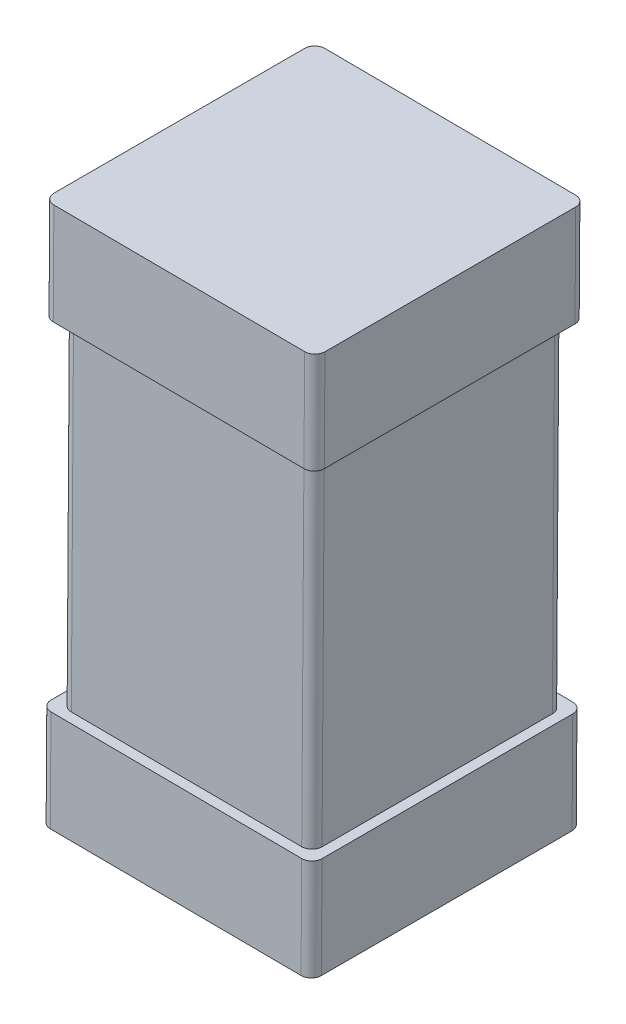
ISO-10303-21;
HEADER;
FILE_DESCRIPTION(('STEP AP214'),'2;1');
FILE_NAME('part.step','',(''),(''),'','','');
FILE_SCHEMA(('AUTOMOTIVE_DESIGN { 1 0 10303 214 1 1 1 1 }'));
ENDSEC;
DATA;
#1=APPLICATION_CONTEXT('core data for automotive mechanical design processes');
#2=APPLICATION_PROTOCOL_DEFINITION('international standard','automotive_design',2000,#1);
#3=PRODUCT_CONTEXT('',#1,'mechanical');
#4=PRODUCT('Part','Part','',(#3));
#5=PRODUCT_RELATED_PRODUCT_CATEGORY('part','',(#4));
#6=PRODUCT_DEFINITION_FORMATION('','',#4);
#7=PRODUCT_DEFINITION_CONTEXT('part definition',#1,'design');
#8=PRODUCT_DEFINITION('design','',#6,#7);
#9=PRODUCT_DEFINITION_SHAPE('','',#8);
#10=(LENGTH_UNIT() NAMED_UNIT(*) SI_UNIT(.MILLI.,.METRE.));
#11=(NAMED_UNIT(*) PLANE_ANGLE_UNIT() SI_UNIT($,.RADIAN.));
#12=(NAMED_UNIT(*) SI_UNIT($,.STERADIAN.) SOLID_ANGLE_UNIT());
#13=UNCERTAINTY_MEASURE_WITH_UNIT(LENGTH_MEASURE(1.E-05),#10,'distance_accuracy_value','');
#14=(GEOMETRIC_REPRESENTATION_CONTEXT(3) GLOBAL_UNCERTAINTY_ASSIGNED_CONTEXT((#13)) GLOBAL_UNIT_ASSIGNED_CONTEXT((#10,
#11,#12)) REPRESENTATION_CONTEXT('',''));
#15=CARTESIAN_POINT('',(0.,0.,0.));
#16=DIRECTION('',(0.,0.,1.));
#17=DIRECTION('',(1.,0.,0.));
#18=AXIS2_PLACEMENT_3D('',#15,#16,#17);
#19=CARTESIAN_POINT('',(207.305024144553,97.4618621310373,142.211582908599));
#20=DIRECTION('',(0.00663069374923689,0.99997801670857,0.));
#21=DIRECTION('',(0.,0.,-1.));
#22=AXIS2_PLACEMENT_3D('',#19,#20,#21);
#23=PLANE('',#22);
#24=DIRECTION('',(0.,0.,1.));
#25=VECTOR('',#24,1.);
#26=CARTESIAN_POINT('',(207.305024144553,97.4618621310373,142.211582908599));
#27=LINE('',#26,#25);
#28=CARTESIAN_POINT('',(207.305024144553,97.4618621310373,142.241582908599));
#29=VERTEX_POINT('',#28);
#30=CARTESIAN_POINT('',(207.305024144553,97.4618621310373,142.981582908599));
#31=VERTEX_POINT('',#30);
#32=EDGE_CURVE('E67',#29,#31,#27,.T.);
#33=ORIENTED_EDGE('',*,*,#32,.F.);
#34=CARTESIAN_POINT('',(207.275024804051,97.4620610518497,142.241582908599));
#35=DIRECTION('',(0.00663069374923689,0.99997801670857,0.));
#36=DIRECTION('',(0.,0.,1.));
#37=AXIS2_PLACEMENT_3D('',#34,#35,#36);
#38=CIRCLE('',#37,0.0300000000000023);
#39=CARTESIAN_POINT('',(207.275024804051,97.4620610518497,142.211582908599));
#40=VERTEX_POINT('',#39);
#41=EDGE_CURVE('E11',#29,#40,#38,.T.);
#42=ORIENTED_EDGE('',*,*,#41,.T.);
#43=DIRECTION('',(-0.999978016708569,0.00663069374923689,0.));
#44=VECTOR('',#43,1.);
#45=CARTESIAN_POINT('',(207.305024144553,97.4618621310373,142.211582908599));
#46=LINE('',#45,#44);
#47=CARTESIAN_POINT('',(206.535041071687,97.4669677652242,142.211582908599));
#48=VERTEX_POINT('',#47);
#49=EDGE_CURVE('E55',#40,#48,#46,.T.);
#50=ORIENTED_EDGE('',*,*,#49,.T.);
#51=CARTESIAN_POINT('',(206.535041071687,97.4669677652242,142.241582908599));
#52=DIRECTION('',(-0.00663069374923689,-0.99997801670857,0.));
#53=DIRECTION('',(0.,0.,1.));
#54=AXIS2_PLACEMENT_3D('',#51,#52,#53);
#55=CIRCLE('',#54,0.0300000000000023);
#56=CARTESIAN_POINT('',(206.505041731186,97.4671666860366,142.241582908599));
#57=VERTEX_POINT('',#56);
#58=EDGE_CURVE('E323',#57,#48,#55,.T.);
#59=ORIENTED_EDGE('',*,*,#58,.F.);
#60=DIRECTION('',(0.,0.,1.));
#61=VECTOR('',#60,1.);
#62=CARTESIAN_POINT('',(206.505041731186,97.4671666860366,142.211582908599));
#63=LINE('',#62,#61);
#64=CARTESIAN_POINT('',(206.505041731186,97.4671666860366,142.981582908599));
#65=VERTEX_POINT('',#64);
#66=EDGE_CURVE('E412',#57,#65,#63,.T.);
#67=ORIENTED_EDGE('',*,*,#66,.T.);
#68=CARTESIAN_POINT('',(206.535041071687,97.4669677652242,142.981582908599));
#69=DIRECTION('',(0.00663069374923689,0.99997801670857,0.));
#70=DIRECTION('',(0.,0.,1.));
#71=AXIS2_PLACEMENT_3D('',#68,#69,#70);
#72=CIRCLE('',#71,0.0300000000000023);
#73=CARTESIAN_POINT('',(206.535041071687,97.4669677652242,143.011582908599));
#74=VERTEX_POINT('',#73);
#75=EDGE_CURVE('E380',#65,#74,#72,.T.);
#76=ORIENTED_EDGE('',*,*,#75,.T.);
#77=DIRECTION('',(-0.999978016708569,0.00663069374923689,0.));
#78=VECTOR('',#77,1.);
#79=CARTESIAN_POINT('',(207.305024144553,97.4618621310373,143.011582908599));
#80=LINE('',#79,#78);
#81=CARTESIAN_POINT('',(207.275024804051,97.4620610518497,143.011582908599));
#82=VERTEX_POINT('',#81);
#83=EDGE_CURVE('E324',#82,#74,#80,.T.);
#84=ORIENTED_EDGE('',*,*,#83,.F.);
#85=CARTESIAN_POINT('',(207.275024804051,97.4620610518497,142.981582908599));
#86=DIRECTION('',(-0.00663069374923689,-0.99997801670857,0.));
#87=DIRECTION('',(0.,0.,1.));
#88=AXIS2_PLACEMENT_3D('',#85,#86,#87);
#89=CIRCLE('',#88,0.0300000000000023);
#90=EDGE_CURVE('E368',#31,#82,#89,.T.);
#91=ORIENTED_EDGE('',*,*,#90,.F.);
#92=EDGE_LOOP('',(#33,#42,#50,#59,#67,#76,#84,#91));
#93=FACE_BOUND('',#92,.T.);
#94=ADVANCED_FACE('F44',(#93),#23,.T.);
#95=CARTESIAN_POINT('',(206.503052523061,97.1671732810241,142.211582908599));
#96=DIRECTION('',(-0.99997801670857,0.00663069374923689,0.));
#97=DIRECTION('',(0.,0.,1.));
#98=AXIS2_PLACEMENT_3D('',#95,#96,#97);
#99=PLANE('',#98);
#100=ORIENTED_EDGE('',*,*,#66,.F.);
#101=DIRECTION('',(0.00663069374923689,0.999978016708569,0.));
#102=VECTOR('',#101,1.);
#103=CARTESIAN_POINT('',(206.503052523061,97.1671732810241,142.241582908599));
#104=LINE('',#103,#102);
#105=CARTESIAN_POINT('',(206.503052523061,97.1671732810241,142.241582908599));
#106=VERTEX_POINT('',#105);
#107=EDGE_CURVE('E347',#106,#57,#104,.T.);
#108=ORIENTED_EDGE('',*,*,#107,.F.);
#109=DIRECTION('',(0.,0.,1.));
#110=VECTOR('',#109,1.);
#111=CARTESIAN_POINT('',(206.503052523061,97.1671732810241,142.211582908599));
#112=LINE('',#111,#110);
#113=CARTESIAN_POINT('',(206.503052523061,97.1671732810241,142.981582908599));
#114=VERTEX_POINT('',#113);
#115=EDGE_CURVE('E376',#106,#114,#112,.T.);
#116=ORIENTED_EDGE('',*,*,#115,.T.);
#117=DIRECTION('',(0.00663069374923689,0.999978016708569,0.));
#118=VECTOR('',#117,1.);
#119=CARTESIAN_POINT('',(206.503052523061,97.1671732810241,142.981582908599));
#120=LINE('',#119,#118);
#121=EDGE_CURVE('E342',#114,#65,#120,.T.);
#122=ORIENTED_EDGE('',*,*,#121,.T.);
#123=EDGE_LOOP('',(#100,#108,#116,#122));
#124=FACE_BOUND('',#123,.T.);
#125=ADVANCED_FACE('F587',(#124),#99,.T.);
#126=CARTESIAN_POINT('',(206.533051863562,97.1669743602116,142.981582908599));
#127=DIRECTION('',(0.00663069374915559,0.99997801670857,0.));
#128=DIRECTION('',(-0.99997801670857,0.00663069374915559,0.));
#129=AXIS2_PLACEMENT_3D('',#126,#127,#128);
#130=CYLINDRICAL_SURFACE('',#129,0.0300000000000117);
#131=CARTESIAN_POINT('',(206.533051863562,97.1669743602116,142.981582908599));
#132=DIRECTION('',(0.00663069374923689,0.99997801670857,0.));
#133=DIRECTION('',(0.,0.,1.));
#134=AXIS2_PLACEMENT_3D('',#131,#132,#133);
#135=CIRCLE('',#134,0.0300000000000023);
#136=CARTESIAN_POINT('',(206.533051863562,97.1669743602116,143.011582908599));
#137=VERTEX_POINT('',#136);
#138=EDGE_CURVE('E338',#114,#137,#135,.T.);
#139=ORIENTED_EDGE('',*,*,#138,.T.);
#140=DIRECTION('',(0.00663069374923689,0.999978016708569,0.));
#141=VECTOR('',#140,1.);
#142=CARTESIAN_POINT('',(206.533051863562,97.1669743602116,143.011582908599));
#143=LINE('',#142,#141);
#144=EDGE_CURVE('E343',#137,#74,#143,.T.);
#145=ORIENTED_EDGE('',*,*,#144,.T.);
#146=ORIENTED_EDGE('',*,*,#75,.F.);
#147=ORIENTED_EDGE('',*,*,#121,.F.);
#148=EDGE_LOOP('',(#139,#145,#146,#147));
#149=FACE_BOUND('',#148,.T.);
#150=ADVANCED_FACE('F591',(#149),#130,.T.);
#151=CARTESIAN_POINT('',(206.533051863562,97.1669743602116,142.241582908599));
#152=DIRECTION('',(0.00663069374915559,0.99997801670857,0.));
#153=DIRECTION('',(-0.99997801670857,0.00663069374915559,0.));
#154=AXIS2_PLACEMENT_3D('',#151,#152,#153);
#155=CYLINDRICAL_SURFACE('',#154,0.0300000000000117);
#156=ORIENTED_EDGE('',*,*,#107,.T.);
#157=ORIENTED_EDGE('',*,*,#58,.T.);
#158=DIRECTION('',(0.00663069374923689,0.999978016708569,0.));
#159=VECTOR('',#158,1.);
#160=CARTESIAN_POINT('',(206.533051863562,97.1669743602116,142.211582908599));
#161=LINE('',#160,#159);
#162=CARTESIAN_POINT('',(206.533051863562,97.1669743602116,142.211582908599));
#163=VERTEX_POINT('',#162);
#164=EDGE_CURVE('E355',#163,#48,#161,.T.);
#165=ORIENTED_EDGE('',*,*,#164,.F.);
#166=CARTESIAN_POINT('',(206.533051863562,97.1669743602116,142.241582908599));
#167=DIRECTION('',(-0.00663069374923689,-0.99997801670857,0.));
#168=DIRECTION('',(0.,0.,1.));
#169=AXIS2_PLACEMENT_3D('',#166,#167,#168);
#170=CIRCLE('',#169,0.0300000000000023);
#171=EDGE_CURVE('E312',#106,#163,#170,.T.);
#172=ORIENTED_EDGE('',*,*,#171,.F.);
#173=EDGE_LOOP('',(#156,#157,#165,#172));
#174=FACE_BOUND('',#173,.T.);
#175=ADVANCED_FACE('F600',(#174),#155,.T.);
#176=CARTESIAN_POINT('',(207.303034936427,97.1618687260247,143.011582908599));
#177=DIRECTION('',(0.,0.,1.));
#178=DIRECTION('',(1.,0.,0.));
#179=AXIS2_PLACEMENT_3D('',#176,#177,#178);
#180=PLANE('',#179);
#181=DIRECTION('',(-0.999978016708569,0.00663069374923689,0.));
#182=VECTOR('',#181,1.);
#183=CARTESIAN_POINT('',(207.303034936427,97.1618687260247,143.011582908599));
#184=LINE('',#183,#182);
#185=CARTESIAN_POINT('',(207.273035595927,97.1620676468372,143.011582908599));
#186=VERTEX_POINT('',#185);
#187=EDGE_CURVE('E314',#186,#137,#184,.T.);
#188=ORIENTED_EDGE('',*,*,#187,.F.);
#189=DIRECTION('',(0.00663069374923689,0.999978016708569,0.));
#190=VECTOR('',#189,1.);
#191=CARTESIAN_POINT('',(207.273035595927,97.1620676468372,143.011582908599));
#192=LINE('',#191,#190);
#193=EDGE_CURVE('E319',#186,#82,#192,.T.);
#194=ORIENTED_EDGE('',*,*,#193,.T.);
#195=ORIENTED_EDGE('',*,*,#83,.T.);
#196=ORIENTED_EDGE('',*,*,#144,.F.);
#197=EDGE_LOOP('',(#188,#194,#195,#196));
#198=FACE_BOUND('',#197,.T.);
#199=ADVANCED_FACE('F603',(#198),#180,.T.);
#200=CARTESIAN_POINT('',(207.303034936427,97.1618687260247,142.211582908599));
#201=DIRECTION('',(0.,0.,1.));
#202=DIRECTION('',(1.,0.,0.));
#203=AXIS2_PLACEMENT_3D('',#200,#201,#202);
#204=PLANE('',#203);
#205=ORIENTED_EDGE('',*,*,#164,.T.);
#206=ORIENTED_EDGE('',*,*,#49,.F.);
#207=DIRECTION('',(0.00663069374923689,0.999978016708569,0.));
#208=VECTOR('',#207,1.);
#209=CARTESIAN_POINT('',(207.273035595927,97.1620676468372,142.211582908599));
#210=LINE('',#209,#208);
#211=CARTESIAN_POINT('',(207.273035595927,97.1620676468372,142.211582908599));
#212=VERTEX_POINT('',#211);
#213=EDGE_CURVE('E399',#212,#40,#210,.T.);
#214=ORIENTED_EDGE('',*,*,#213,.F.);
#215=DIRECTION('',(-0.999978016708569,0.00663069374923689,0.));
#216=VECTOR('',#215,1.);
#217=CARTESIAN_POINT('',(207.303034936427,97.1618687260247,142.211582908599));
#218=LINE('',#217,#216);
#219=EDGE_CURVE('E351',#212,#163,#218,.T.);
#220=ORIENTED_EDGE('',*,*,#219,.T.);
#221=EDGE_LOOP('',(#205,#206,#214,#220));
#222=FACE_BOUND('',#221,.T.);
#223=ADVANCED_FACE('F609',(#222),#204,.F.);
#224=CARTESIAN_POINT('',(207.273035595927,97.1620676468372,142.981582908599));
#225=DIRECTION('',(0.00663069374915559,0.99997801670857,0.));
#226=DIRECTION('',(0.99997801670857,-0.00663069374915559,0.));
#227=AXIS2_PLACEMENT_3D('',#224,#225,#226);
#228=CYLINDRICAL_SURFACE('',#227,0.0300000000000117);
#229=DIRECTION('',(0.00663069374923689,0.999978016708569,0.));
#230=VECTOR('',#229,1.);
#231=CARTESIAN_POINT('',(207.303034936427,97.1618687260247,142.981582908599));
#232=LINE('',#231,#230);
#233=CARTESIAN_POINT('',(207.303034936427,97.1618687260247,142.981582908599));
#234=VERTEX_POINT('',#233);
#235=EDGE_CURVE('E356',#234,#31,#232,.T.);
#236=ORIENTED_EDGE('',*,*,#235,.T.);
#237=ORIENTED_EDGE('',*,*,#90,.T.);
#238=ORIENTED_EDGE('',*,*,#193,.F.);
#239=CARTESIAN_POINT('',(207.273035595927,97.1620676468372,142.981582908599));
#240=DIRECTION('',(-0.00663069374923689,-0.99997801670857,0.));
#241=DIRECTION('',(0.,0.,1.));
#242=AXIS2_PLACEMENT_3D('',#239,#240,#241);
#243=CIRCLE('',#242,0.0300000000000023);
#244=EDGE_CURVE('E318',#234,#186,#243,.T.);
#245=ORIENTED_EDGE('',*,*,#244,.F.);
#246=EDGE_LOOP('',(#236,#237,#238,#245));
#247=FACE_BOUND('',#246,.T.);
#248=ADVANCED_FACE('F543',(#247),#228,.T.);
#249=CARTESIAN_POINT('',(207.273035595927,97.1620676468372,142.241582908599));
#250=DIRECTION('',(0.00663069374915559,0.99997801670857,0.));
#251=DIRECTION('',(0.99997801670857,-0.00663069374915559,0.));
#252=AXIS2_PLACEMENT_3D('',#249,#250,#251);
#253=CYLINDRICAL_SURFACE('',#252,0.0300000000000117);
#254=CARTESIAN_POINT('',(207.273035595927,97.1620676468372,142.241582908599));
#255=DIRECTION('',(0.00663069374923689,0.99997801670857,0.));
#256=DIRECTION('',(0.,0.,1.));
#257=AXIS2_PLACEMENT_3D('',#254,#255,#256);
#258=CIRCLE('',#257,0.0300000000000023);
#259=CARTESIAN_POINT('',(207.303034936427,97.1618687260247,142.241582908599));
#260=VERTEX_POINT('',#259);
#261=EDGE_CURVE('E297',#260,#212,#258,.T.);
#262=ORIENTED_EDGE('',*,*,#261,.T.);
#263=ORIENTED_EDGE('',*,*,#213,.T.);
#264=ORIENTED_EDGE('',*,*,#41,.F.);
#265=DIRECTION('',(0.00663069374923689,0.999978016708569,0.));
#266=VECTOR('',#265,1.);
#267=CARTESIAN_POINT('',(207.303034936427,97.1618687260247,142.241582908599));
#268=LINE('',#267,#266);
#269=EDGE_CURVE('E403',#260,#29,#268,.T.);
#270=ORIENTED_EDGE('',*,*,#269,.F.);
#271=EDGE_LOOP('',(#262,#263,#264,#270));
#272=FACE_BOUND('',#271,.T.);
#273=ADVANCED_FACE('F533',(#272),#253,.T.);
#274=CARTESIAN_POINT('',(207.303034936427,97.1618687260247,142.211582908599));
#275=DIRECTION('',(-0.99997801670857,0.00663069374923689,0.));
#276=DIRECTION('',(0.,0.,1.));
#277=AXIS2_PLACEMENT_3D('',#274,#275,#276);
#278=PLANE('',#277);
#279=ORIENTED_EDGE('',*,*,#235,.F.);
#280=DIRECTION('',(0.,0.,1.));
#281=VECTOR('',#280,1.);
#282=CARTESIAN_POINT('',(207.303034936427,97.1618687260247,142.211582908599));
#283=LINE('',#282,#281);
#284=EDGE_CURVE('E308',#260,#234,#283,.T.);
#285=ORIENTED_EDGE('',*,*,#284,.F.);
#286=ORIENTED_EDGE('',*,*,#269,.T.);
#287=ORIENTED_EDGE('',*,*,#32,.T.);
#288=EDGE_LOOP('',(#279,#285,#286,#287));
#289=FACE_BOUND('',#288,.T.);
#290=ADVANCED_FACE('F541',(#289),#278,.F.);
#291=CARTESIAN_POINT('',(207.303034936427,97.1618687260247,142.211582908599));
#292=DIRECTION('',(0.00663069374923689,0.99997801670857,0.));
#293=DIRECTION('',(0.,0.,-1.));
#294=AXIS2_PLACEMENT_3D('',#291,#292,#293);
#295=PLANE('',#294);
#296=ORIENTED_EDGE('',*,*,#244,.T.);
#297=ORIENTED_EDGE('',*,*,#187,.T.);
#298=ORIENTED_EDGE('',*,*,#138,.F.);
#299=ORIENTED_EDGE('',*,*,#115,.F.);
#300=ORIENTED_EDGE('',*,*,#171,.T.);
#301=ORIENTED_EDGE('',*,*,#219,.F.);
#302=ORIENTED_EDGE('',*,*,#261,.F.);
#303=ORIENTED_EDGE('',*,*,#284,.T.);
#304=EDGE_LOOP('',(#296,#297,#298,#299,#300,#301,#302,#303));
#305=FACE_BOUND('',#304,.T.);
#306=DIRECTION('',(-0.999978016708569,0.00663069374923689,0.));
#307=VECTOR('',#306,1.);
#308=CARTESIAN_POINT('',(207.273035595927,97.1620676468372,142.241582908599));
#309=LINE('',#308,#307);
#310=CARTESIAN_POINT('',(207.243036255425,97.1622665676496,142.241582908599));
#311=VERTEX_POINT('',#310);
#312=CARTESIAN_POINT('',(206.563051204063,97.1667754393991,142.241582908599));
#313=VERTEX_POINT('',#312);
#314=EDGE_CURVE('E313',#311,#313,#309,.T.);
#315=ORIENTED_EDGE('',*,*,#314,.T.);
#316=CARTESIAN_POINT('',(206.563051204063,97.1667754393991,142.271582908599));
#317=DIRECTION('',(-0.00663069374923689,-0.99997801670857,0.));
#318=DIRECTION('',(0.,0.,1.));
#319=AXIS2_PLACEMENT_3D('',#316,#317,#318);
#320=CIRCLE('',#319,0.0300000000000023);
#321=CARTESIAN_POINT('',(206.533051863562,97.1669743602116,142.271582908599));
#322=VERTEX_POINT('',#321);
#323=EDGE_CURVE('E334',#322,#313,#320,.T.);
#324=ORIENTED_EDGE('',*,*,#323,.F.);
#325=DIRECTION('',(0.,0.,1.));
#326=VECTOR('',#325,1.);
#327=CARTESIAN_POINT('',(206.533051863562,97.1669743602116,142.241582908599));
#328=LINE('',#327,#326);
#329=CARTESIAN_POINT('',(206.533051863562,97.1669743602116,142.951582908599));
#330=VERTEX_POINT('',#329);
#331=EDGE_CURVE('E419',#322,#330,#328,.T.);
#332=ORIENTED_EDGE('',*,*,#331,.T.);
#333=CARTESIAN_POINT('',(206.563051204063,97.1667754393991,142.951582908599));
#334=DIRECTION('',(0.00663069374923689,0.99997801670857,0.));
#335=DIRECTION('',(0.,0.,1.));
#336=AXIS2_PLACEMENT_3D('',#333,#334,#335);
#337=CIRCLE('',#336,0.0300000000000023);
#338=CARTESIAN_POINT('',(206.563051204063,97.1667754393991,142.981582908599));
#339=VERTEX_POINT('',#338);
#340=EDGE_CURVE('E437',#330,#339,#337,.T.);
#341=ORIENTED_EDGE('',*,*,#340,.T.);
#342=DIRECTION('',(-0.999978016708569,0.00663069374923689,0.));
#343=VECTOR('',#342,1.);
#344=CARTESIAN_POINT('',(207.273035595927,97.1620676468372,142.981582908599));
#345=LINE('',#344,#343);
#346=CARTESIAN_POINT('',(207.243036255425,97.1622665676496,142.981582908599));
#347=VERTEX_POINT('',#346);
#348=EDGE_CURVE('E303',#347,#339,#345,.T.);
#349=ORIENTED_EDGE('',*,*,#348,.F.);
#350=CARTESIAN_POINT('',(207.243036255425,97.1622665676496,142.951582908599));
#351=DIRECTION('',(-0.00663069374923689,-0.99997801670857,0.));
#352=DIRECTION('',(0.,0.,1.));
#353=AXIS2_PLACEMENT_3D('',#350,#351,#352);
#354=CIRCLE('',#353,0.0300000000000023);
#355=CARTESIAN_POINT('',(207.273035595927,97.1620676468372,142.951582908599));
#356=VERTEX_POINT('',#355);
#357=EDGE_CURVE('E469',#356,#347,#354,.T.);
#358=ORIENTED_EDGE('',*,*,#357,.F.);
#359=DIRECTION('',(0.,0.,1.));
#360=VECTOR('',#359,1.);
#361=CARTESIAN_POINT('',(207.273035595927,97.1620676468372,142.241582908599));
#362=LINE('',#361,#360);
#363=CARTESIAN_POINT('',(207.273035595927,97.1620676468372,142.271582908599));
#364=VERTEX_POINT('',#363);
#365=EDGE_CURVE('E456',#364,#356,#362,.T.);
#366=ORIENTED_EDGE('',*,*,#365,.F.);
#367=CARTESIAN_POINT('',(207.243036255425,97.1622665676496,142.271582908599));
#368=DIRECTION('',(0.00663069374923689,0.99997801670857,0.));
#369=DIRECTION('',(0.,0.,1.));
#370=AXIS2_PLACEMENT_3D('',#367,#368,#369);
#371=CIRCLE('',#370,0.0300000000000023);
#372=EDGE_CURVE('E455',#364,#311,#371,.T.);
#373=ORIENTED_EDGE('',*,*,#372,.T.);
#374=EDGE_LOOP('',(#315,#324,#332,#341,#349,#358,#366,#373));
#375=FACE_BOUND('',#374,.T.);
#376=ADVANCED_FACE('F538',(#305,#375),#295,.F.);
#377=CARTESIAN_POINT('',(207.266404902177,96.1620896301286,142.241582908599));
#378=DIRECTION('',(-0.99997801670857,0.00663069374923689,0.));
#379=DIRECTION('',(0.,0.,1.));
#380=AXIS2_PLACEMENT_3D('',#377,#378,#379);
#381=PLANE('',#380);
#382=DIRECTION('',(0.00663069374923689,0.999978016708569,0.));
#383=VECTOR('',#382,1.);
#384=CARTESIAN_POINT('',(207.266404902177,96.1620896301286,142.951582908599));
#385=LINE('',#384,#383);
#386=CARTESIAN_POINT('',(207.266404902177,96.1620896301286,142.951582908599));
#387=VERTEX_POINT('',#386);
#388=EDGE_CURVE('E465',#387,#356,#385,.T.);
#389=ORIENTED_EDGE('',*,*,#388,.F.);
#390=DIRECTION('',(0.,0.,1.));
#391=VECTOR('',#390,1.);
#392=CARTESIAN_POINT('',(207.266404902177,96.1620896301286,142.241582908599));
#393=LINE('',#392,#391);
#394=CARTESIAN_POINT('',(207.266404902177,96.1620896301286,142.271582908599));
#395=VERTEX_POINT('',#394);
#396=EDGE_CURVE('E276',#395,#387,#393,.T.);
#397=ORIENTED_EDGE('',*,*,#396,.F.);
#398=DIRECTION('',(0.00663069374923689,0.999978016708569,0.));
#399=VECTOR('',#398,1.);
#400=CARTESIAN_POINT('',(207.266404902177,96.1620896301286,142.271582908599));
#401=LINE('',#400,#399);
#402=EDGE_CURVE('E451',#395,#364,#401,.T.);
#403=ORIENTED_EDGE('',*,*,#402,.T.);
#404=ORIENTED_EDGE('',*,*,#365,.T.);
#405=EDGE_LOOP('',(#389,#397,#403,#404));
#406=FACE_BOUND('',#405,.T.);
#407=ADVANCED_FACE('F559',(#406),#381,.F.);
#408=CARTESIAN_POINT('',(207.236405561676,96.1622885509411,142.951582908599));
#409=DIRECTION('',(0.00663069374915559,0.99997801670857,0.));
#410=DIRECTION('',(0.99997801670857,-0.00663069374915559,0.));
#411=AXIS2_PLACEMENT_3D('',#408,#409,#410);
#412=CYLINDRICAL_SURFACE('',#411,0.0300000000000117);
#413=ORIENTED_EDGE('',*,*,#388,.T.);
#414=ORIENTED_EDGE('',*,*,#357,.T.);
#415=DIRECTION('',(0.00663069374923689,0.999978016708569,0.));
#416=VECTOR('',#415,1.);
#417=CARTESIAN_POINT('',(207.236405561676,96.1622885509411,142.981582908599));
#418=LINE('',#417,#416);
#419=CARTESIAN_POINT('',(207.236405561676,96.1622885509411,142.981582908599));
#420=VERTEX_POINT('',#419);
#421=EDGE_CURVE('E305',#420,#347,#418,.T.);
#422=ORIENTED_EDGE('',*,*,#421,.F.);
#423=CARTESIAN_POINT('',(207.236405561676,96.1622885509411,142.951582908599));
#424=DIRECTION('',(-0.00663069374923689,-0.99997801670857,0.));
#425=DIRECTION('',(0.,0.,1.));
#426=AXIS2_PLACEMENT_3D('',#423,#424,#425);
#427=CIRCLE('',#426,0.0300000000000023);
#428=EDGE_CURVE('E386',#387,#420,#427,.T.);
#429=ORIENTED_EDGE('',*,*,#428,.F.);
#430=EDGE_LOOP('',(#413,#414,#422,#429));
#431=FACE_BOUND('',#430,.T.);
#432=ADVANCED_FACE('F556',(#431),#412,.T.);
#433=CARTESIAN_POINT('',(207.266404902177,96.1620896301286,142.981582908599));
#434=DIRECTION('',(0.,0.,1.));
#435=DIRECTION('',(1.,0.,0.));
#436=AXIS2_PLACEMENT_3D('',#433,#434,#435);
#437=PLANE('',#436);
#438=DIRECTION('',(-0.999978016708569,0.00663069374923689,0.));
#439=VECTOR('',#438,1.);
#440=CARTESIAN_POINT('',(207.266404902177,96.1620896301286,142.981582908599));
#441=LINE('',#440,#439);
#442=CARTESIAN_POINT('',(206.556420510314,96.1667974226905,142.981582908599));
#443=VERTEX_POINT('',#442);
#444=EDGE_CURVE('E360',#420,#443,#441,.T.);
#445=ORIENTED_EDGE('',*,*,#444,.F.);
#446=ORIENTED_EDGE('',*,*,#421,.T.);
#447=ORIENTED_EDGE('',*,*,#348,.T.);
#448=DIRECTION('',(0.00663069374923689,0.999978016708569,0.));
#449=VECTOR('',#448,1.);
#450=CARTESIAN_POINT('',(206.556420510314,96.1667974226905,142.981582908599));
#451=LINE('',#450,#449);
#452=EDGE_CURVE('E394',#443,#339,#451,.T.);
#453=ORIENTED_EDGE('',*,*,#452,.F.);
#454=EDGE_LOOP('',(#445,#446,#447,#453));
#455=FACE_BOUND('',#454,.T.);
#456=ADVANCED_FACE('F46',(#455),#437,.T.);
#457=CARTESIAN_POINT('',(206.556420510314,96.1667974226905,142.951582908599));
#458=DIRECTION('',(0.00663069374915559,0.99997801670857,0.));
#459=DIRECTION('',(-0.99997801670857,0.00663069374915559,0.));
#460=AXIS2_PLACEMENT_3D('',#457,#458,#459);
#461=CYLINDRICAL_SURFACE('',#460,0.0300000000000117);
#462=CARTESIAN_POINT('',(206.556420510314,96.1667974226905,142.951582908599));
#463=DIRECTION('',(0.00663069374923689,0.99997801670857,0.));
#464=DIRECTION('',(0.,0.,1.));
#465=AXIS2_PLACEMENT_3D('',#462,#463,#464);
#466=CIRCLE('',#465,0.0300000000000023);
#467=CARTESIAN_POINT('',(206.526421169813,96.166996343503,142.951582908599));
#468=VERTEX_POINT('',#467);
#469=EDGE_CURVE('E306',#468,#443,#466,.T.);
#470=ORIENTED_EDGE('',*,*,#469,.T.);
#471=ORIENTED_EDGE('',*,*,#452,.T.);
#472=ORIENTED_EDGE('',*,*,#340,.F.);
#473=DIRECTION('',(0.00663069374923689,0.999978016708569,0.));
#474=VECTOR('',#473,1.);
#475=CARTESIAN_POINT('',(206.526421169813,96.166996343503,142.951582908599));
#476=LINE('',#475,#474);
#477=EDGE_CURVE('E426',#468,#330,#476,.T.);
#478=ORIENTED_EDGE('',*,*,#477,.F.);
#479=EDGE_LOOP('',(#470,#471,#472,#478));
#480=FACE_BOUND('',#479,.T.);
#481=ADVANCED_FACE('F582',(#480),#461,.T.);
#482=CARTESIAN_POINT('',(206.526421169813,96.166996343503,142.241582908599));
#483=DIRECTION('',(-0.99997801670857,0.00663069374923689,0.));
#484=DIRECTION('',(0.,0.,1.));
#485=AXIS2_PLACEMENT_3D('',#482,#483,#484);
#486=PLANE('',#485);
#487=ORIENTED_EDGE('',*,*,#331,.F.);
#488=DIRECTION('',(0.00663069374923689,0.999978016708569,0.));
#489=VECTOR('',#488,1.);
#490=CARTESIAN_POINT('',(206.526421169813,96.166996343503,142.271582908599));
#491=LINE('',#490,#489);
#492=CARTESIAN_POINT('',(206.526421169813,96.166996343503,142.271582908599));
#493=VERTEX_POINT('',#492);
#494=EDGE_CURVE('E337',#493,#322,#491,.T.);
#495=ORIENTED_EDGE('',*,*,#494,.F.);
#496=DIRECTION('',(0.,0.,1.));
#497=VECTOR('',#496,1.);
#498=CARTESIAN_POINT('',(206.526421169813,96.166996343503,142.241582908599));
#499=LINE('',#498,#497);
#500=EDGE_CURVE('E430',#493,#468,#499,.T.);
#501=ORIENTED_EDGE('',*,*,#500,.T.);
#502=ORIENTED_EDGE('',*,*,#477,.T.);
#503=EDGE_LOOP('',(#487,#495,#501,#502));
#504=FACE_BOUND('',#503,.T.);
#505=ADVANCED_FACE('F573',(#504),#486,.T.);
#506=CARTESIAN_POINT('',(206.556420510314,96.1667974226905,142.271582908599));
#507=DIRECTION('',(0.00663069374915559,0.99997801670857,0.));
#508=DIRECTION('',(-0.99997801670857,0.00663069374915559,0.));
#509=AXIS2_PLACEMENT_3D('',#506,#507,#508);
#510=CYLINDRICAL_SURFACE('',#509,0.0300000000000117);
#511=ORIENTED_EDGE('',*,*,#494,.T.);
#512=ORIENTED_EDGE('',*,*,#323,.T.);
#513=DIRECTION('',(0.00663069374923689,0.999978016708569,0.));
#514=VECTOR('',#513,1.);
#515=CARTESIAN_POINT('',(206.556420510314,96.1667974226905,142.241582908599));
#516=LINE('',#515,#514);
#517=CARTESIAN_POINT('',(206.556420510314,96.1667974226905,142.241582908599));
#518=VERTEX_POINT('',#517);
#519=EDGE_CURVE('E332',#518,#313,#516,.T.);
#520=ORIENTED_EDGE('',*,*,#519,.F.);
#521=CARTESIAN_POINT('',(206.556420510314,96.1667974226905,142.271582908599));
#522=DIRECTION('',(-0.00663069374923689,-0.99997801670857,0.));
#523=DIRECTION('',(0.,0.,1.));
#524=AXIS2_PLACEMENT_3D('',#521,#522,#523);
#525=CIRCLE('',#524,0.0300000000000023);
#526=EDGE_CURVE('E357',#493,#518,#525,.T.);
#527=ORIENTED_EDGE('',*,*,#526,.F.);
#528=EDGE_LOOP('',(#511,#512,#520,#527));
#529=FACE_BOUND('',#528,.T.);
#530=ADVANCED_FACE('F574',(#529),#510,.T.);
#531=CARTESIAN_POINT('',(207.266404902177,96.1620896301286,142.241582908599));
#532=DIRECTION('',(0.,0.,1.));
#533=DIRECTION('',(1.,0.,0.));
#534=AXIS2_PLACEMENT_3D('',#531,#532,#533);
#535=PLANE('',#534);
#536=ORIENTED_EDGE('',*,*,#519,.T.);
#537=ORIENTED_EDGE('',*,*,#314,.F.);
#538=DIRECTION('',(0.00663069374923689,0.999978016708569,0.));
#539=VECTOR('',#538,1.);
#540=CARTESIAN_POINT('',(207.236405561676,96.1622885509411,142.241582908599));
#541=LINE('',#540,#539);
#542=CARTESIAN_POINT('',(207.236405561676,96.1622885509411,142.241582908599));
#543=VERTEX_POINT('',#542);
#544=EDGE_CURVE('E398',#543,#311,#541,.T.);
#545=ORIENTED_EDGE('',*,*,#544,.F.);
#546=DIRECTION('',(-0.999978016708569,0.00663069374923689,0.));
#547=VECTOR('',#546,1.);
#548=CARTESIAN_POINT('',(207.266404902177,96.1620896301286,142.241582908599));
#549=LINE('',#548,#547);
#550=EDGE_CURVE('E328',#543,#518,#549,.T.);
#551=ORIENTED_EDGE('',*,*,#550,.T.);
#552=EDGE_LOOP('',(#536,#537,#545,#551));
#553=FACE_BOUND('',#552,.T.);
#554=ADVANCED_FACE('F569',(#553),#535,.F.);
#555=CARTESIAN_POINT('',(207.236405561676,96.1622885509411,142.271582908599));
#556=DIRECTION('',(0.00663069374915559,0.99997801670857,0.));
#557=DIRECTION('',(0.99997801670857,-0.00663069374915559,0.));
#558=AXIS2_PLACEMENT_3D('',#555,#556,#557);
#559=CYLINDRICAL_SURFACE('',#558,0.0300000000000117);
#560=CARTESIAN_POINT('',(207.236405561676,96.1622885509411,142.271582908599));
#561=DIRECTION('',(0.00663069374923689,0.99997801670857,0.));
#562=DIRECTION('',(0.,0.,1.));
#563=AXIS2_PLACEMENT_3D('',#560,#561,#562);
#564=CIRCLE('',#563,0.0300000000000023);
#565=EDGE_CURVE('E333',#395,#543,#564,.T.);
#566=ORIENTED_EDGE('',*,*,#565,.T.);
#567=ORIENTED_EDGE('',*,*,#544,.T.);
#568=ORIENTED_EDGE('',*,*,#372,.F.);
#569=ORIENTED_EDGE('',*,*,#402,.F.);
#570=EDGE_LOOP('',(#566,#567,#568,#569));
#571=FACE_BOUND('',#570,.T.);
#572=ADVANCED_FACE('F563',(#571),#559,.T.);
#573=CARTESIAN_POINT('',(207.296404242679,96.1618907093161,142.211582908599));
#574=DIRECTION('',(0.00663069374923689,0.99997801670857,0.));
#575=DIRECTION('',(0.,0.,-1.));
#576=AXIS2_PLACEMENT_3D('',#573,#574,#575);
#577=PLANE('',#576);
#578=DIRECTION('',(0.,0.,1.));
#579=VECTOR('',#578,1.);
#580=CARTESIAN_POINT('',(207.296404242679,96.1618907093161,142.211582908599));
#581=LINE('',#580,#579);
#582=CARTESIAN_POINT('',(207.296404242679,96.1618907093161,142.241582908599));
#583=VERTEX_POINT('',#582);
#584=CARTESIAN_POINT('',(207.296404242679,96.1618907093161,142.981582908599));
#585=VERTEX_POINT('',#584);
#586=EDGE_CURVE('E385',#583,#585,#581,.T.);
#587=ORIENTED_EDGE('',*,*,#586,.F.);
#588=CARTESIAN_POINT('',(207.266404902177,96.1620896301286,142.241582908599));
#589=DIRECTION('',(0.00663069374923689,0.99997801670857,0.));
#590=DIRECTION('',(0.,0.,1.));
#591=AXIS2_PLACEMENT_3D('',#588,#589,#590);
#592=CIRCLE('',#591,0.0300000000000023);
#593=CARTESIAN_POINT('',(207.266404902177,96.1620896301286,142.211582908599));
#594=VERTEX_POINT('',#593);
#595=EDGE_CURVE('E372',#583,#594,#592,.T.);
#596=ORIENTED_EDGE('',*,*,#595,.T.);
#597=DIRECTION('',(-0.999978016708569,0.00663069374923689,0.));
#598=VECTOR('',#597,1.);
#599=CARTESIAN_POINT('',(207.296404242679,96.1618907093161,142.211582908599));
#600=LINE('',#599,#598);
#601=CARTESIAN_POINT('',(206.526421169813,96.166996343503,142.211582908599));
#602=VERTEX_POINT('',#601);
#603=EDGE_CURVE('E327',#594,#602,#600,.T.);
#604=ORIENTED_EDGE('',*,*,#603,.T.);
#605=CARTESIAN_POINT('',(206.526421169813,96.166996343503,142.241582908599));
#606=DIRECTION('',(-0.00663069374923689,-0.99997801670857,0.));
#607=DIRECTION('',(0.,0.,1.));
#608=AXIS2_PLACEMENT_3D('',#605,#606,#607);
#609=CIRCLE('',#608,0.0300000000000023);
#610=CARTESIAN_POINT('',(206.496421829311,96.1671952643155,142.241582908599));
#611=VERTEX_POINT('',#610);
#612=EDGE_CURVE('E293',#611,#602,#609,.T.);
#613=ORIENTED_EDGE('',*,*,#612,.F.);
#614=DIRECTION('',(0.,0.,1.));
#615=VECTOR('',#614,1.);
#616=CARTESIAN_POINT('',(206.496421829311,96.1671952643155,142.211582908599));
#617=LINE('',#616,#615);
#618=CARTESIAN_POINT('',(206.496421829311,96.1671952643155,142.981582908599));
#619=VERTEX_POINT('',#618);
#620=EDGE_CURVE('E272',#611,#619,#617,.T.);
#621=ORIENTED_EDGE('',*,*,#620,.T.);
#622=CARTESIAN_POINT('',(206.526421169813,96.166996343503,142.981582908599));
#623=DIRECTION('',(0.00663069374923689,0.99997801670857,0.));
#624=DIRECTION('',(0.,0.,1.));
#625=AXIS2_PLACEMENT_3D('',#622,#623,#624);
#626=CIRCLE('',#625,0.0300000000000023);
#627=CARTESIAN_POINT('',(206.526421169813,96.166996343503,143.011582908599));
#628=VERTEX_POINT('',#627);
#629=EDGE_CURVE('E268',#619,#628,#626,.T.);
#630=ORIENTED_EDGE('',*,*,#629,.T.);
#631=DIRECTION('',(-0.999978016708569,0.00663069374923689,0.));
#632=VECTOR('',#631,1.);
#633=CARTESIAN_POINT('',(207.296404242679,96.1618907093161,143.011582908599));
#634=LINE('',#633,#632);
#635=CARTESIAN_POINT('',(207.266404902177,96.1620896301286,143.011582908599));
#636=VERTEX_POINT('',#635);
#637=EDGE_CURVE('E254',#636,#628,#634,.T.);
#638=ORIENTED_EDGE('',*,*,#637,.F.);
#639=CARTESIAN_POINT('',(207.266404902177,96.1620896301286,142.981582908599));
#640=DIRECTION('',(-0.00663069374923689,-0.99997801670857,0.));
#641=DIRECTION('',(0.,0.,1.));
#642=AXIS2_PLACEMENT_3D('',#639,#640,#641);
#643=CIRCLE('',#642,0.0300000000000023);
#644=EDGE_CURVE('E302',#585,#636,#643,.T.);
#645=ORIENTED_EDGE('',*,*,#644,.F.);
#646=EDGE_LOOP('',(#587,#596,#604,#613,#621,#630,#638,#645));
#647=FACE_BOUND('',#646,.T.);
#648=ORIENTED_EDGE('',*,*,#565,.F.);
#649=ORIENTED_EDGE('',*,*,#396,.T.);
#650=ORIENTED_EDGE('',*,*,#428,.T.);
#651=ORIENTED_EDGE('',*,*,#444,.T.);
#652=ORIENTED_EDGE('',*,*,#469,.F.);
#653=ORIENTED_EDGE('',*,*,#500,.F.);
#654=ORIENTED_EDGE('',*,*,#526,.T.);
#655=ORIENTED_EDGE('',*,*,#550,.F.);
#656=EDGE_LOOP('',(#648,#649,#650,#651,#652,#653,#654,#655));
#657=FACE_BOUND('',#656,.T.);
#658=ADVANCED_FACE('F269',(#647,#657),#577,.T.);
#659=CARTESIAN_POINT('',(206.494432621186,95.8672018593029,142.211582908599));
#660=DIRECTION('',(-0.99997801670857,0.00663069374923689,0.));
#661=DIRECTION('',(0.,0.,1.));
#662=AXIS2_PLACEMENT_3D('',#659,#660,#661);
#663=PLANE('',#662);
#664=ORIENTED_EDGE('',*,*,#620,.F.);
#665=DIRECTION('',(0.00663069374923689,0.999978016708569,0.));
#666=VECTOR('',#665,1.);
#667=CARTESIAN_POINT('',(206.494432621186,95.8672018593029,142.241582908599));
#668=LINE('',#667,#666);
#669=CARTESIAN_POINT('',(206.494432621186,95.8672018593029,142.241582908599));
#670=VERTEX_POINT('',#669);
#671=EDGE_CURVE('E283',#670,#611,#668,.T.);
#672=ORIENTED_EDGE('',*,*,#671,.F.);
#673=DIRECTION('',(0.,0.,1.));
#674=VECTOR('',#673,1.);
#675=CARTESIAN_POINT('',(206.494432621186,95.8672018593029,142.211582908599));
#676=LINE('',#675,#674);
#677=CARTESIAN_POINT('',(206.494432621186,95.8672018593029,142.981582908599));
#678=VERTEX_POINT('',#677);
#679=EDGE_CURVE('E361',#670,#678,#676,.T.);
#680=ORIENTED_EDGE('',*,*,#679,.T.);
#681=DIRECTION('',(0.00663069374923689,0.999978016708569,0.));
#682=VECTOR('',#681,1.);
#683=CARTESIAN_POINT('',(206.494432621186,95.8672018593029,142.981582908599));
#684=LINE('',#683,#682);
#685=EDGE_CURVE('E289',#678,#619,#684,.T.);
#686=ORIENTED_EDGE('',*,*,#685,.T.);
#687=EDGE_LOOP('',(#664,#672,#680,#686));
#688=FACE_BOUND('',#687,.T.);
#689=ADVANCED_FACE('F638',(#688),#663,.T.);
#690=CARTESIAN_POINT('',(206.524431961688,95.8670029384904,142.981582908599));
#691=DIRECTION('',(0.00663069374915559,0.99997801670857,0.));
#692=DIRECTION('',(-0.99997801670857,0.00663069374915559,0.));
#693=AXIS2_PLACEMENT_3D('',#690,#691,#692);
#694=CYLINDRICAL_SURFACE('',#693,0.0300000000000117);
#695=CARTESIAN_POINT('',(206.524431961688,95.8670029384904,142.981582908599));
#696=DIRECTION('',(0.00663069374923689,0.99997801670857,0.));
#697=DIRECTION('',(0.,0.,1.));
#698=AXIS2_PLACEMENT_3D('',#695,#696,#697);
#699=CIRCLE('',#698,0.0300000000000023);
#700=CARTESIAN_POINT('',(206.524431961688,95.8670029384904,143.011582908599));
#701=VERTEX_POINT('',#700);
#702=EDGE_CURVE('E280',#678,#701,#699,.T.);
#703=ORIENTED_EDGE('',*,*,#702,.T.);
#704=DIRECTION('',(0.00663069374923689,0.999978016708569,0.));
#705=VECTOR('',#704,1.);
#706=CARTESIAN_POINT('',(206.524431961688,95.8670029384904,143.011582908599));
#707=LINE('',#706,#705);
#708=EDGE_CURVE('E258',#701,#628,#707,.T.);
#709=ORIENTED_EDGE('',*,*,#708,.T.);
#710=ORIENTED_EDGE('',*,*,#629,.F.);
#711=ORIENTED_EDGE('',*,*,#685,.F.);
#712=EDGE_LOOP('',(#703,#709,#710,#711));
#713=FACE_BOUND('',#712,.T.);
#714=ADVANCED_FACE('F278',(#713),#694,.T.);
#715=CARTESIAN_POINT('',(206.524431961688,95.8670029384904,142.241582908599));
#716=DIRECTION('',(0.00663069374915559,0.99997801670857,0.));
#717=DIRECTION('',(-0.99997801670857,0.00663069374915559,0.));
#718=AXIS2_PLACEMENT_3D('',#715,#716,#717);
#719=CYLINDRICAL_SURFACE('',#718,0.0300000000000117);
#720=ORIENTED_EDGE('',*,*,#671,.T.);
#721=ORIENTED_EDGE('',*,*,#612,.T.);
#722=DIRECTION('',(0.00663069374923689,0.999978016708569,0.));
#723=VECTOR('',#722,1.);
#724=CARTESIAN_POINT('',(206.524431961688,95.8670029384904,142.211582908599));
#725=LINE('',#724,#723);
#726=CARTESIAN_POINT('',(206.524431961688,95.8670029384904,142.211582908599));
#727=VERTEX_POINT('',#726);
#728=EDGE_CURVE('E265',#727,#602,#725,.T.);
#729=ORIENTED_EDGE('',*,*,#728,.F.);
#730=CARTESIAN_POINT('',(206.524431961688,95.8670029384904,142.241582908599));
#731=DIRECTION('',(-0.00663069374923689,-0.99997801670857,0.));
#732=DIRECTION('',(0.,0.,1.));
#733=AXIS2_PLACEMENT_3D('',#730,#731,#732);
#734=CIRCLE('',#733,0.0300000000000023);
#735=EDGE_CURVE('E408',#670,#727,#734,.T.);
#736=ORIENTED_EDGE('',*,*,#735,.F.);
#737=EDGE_LOOP('',(#720,#721,#729,#736));
#738=FACE_BOUND('',#737,.T.);
#739=ADVANCED_FACE('F608',(#738),#719,.T.);
#740=CARTESIAN_POINT('',(207.294415034554,95.8618973043035,143.011582908599));
#741=DIRECTION('',(0.,0.,1.));
#742=DIRECTION('',(1.,0.,0.));
#743=AXIS2_PLACEMENT_3D('',#740,#741,#742);
#744=PLANE('',#743);
#745=DIRECTION('',(-0.999978016708569,0.00663069374923689,0.));
#746=VECTOR('',#745,1.);
#747=CARTESIAN_POINT('',(207.294415034554,95.8618973043035,143.011582908599));
#748=LINE('',#747,#746);
#749=CARTESIAN_POINT('',(207.264415694053,95.862096225116,143.011582908599));
#750=VERTEX_POINT('',#749);
#751=EDGE_CURVE('E404',#750,#701,#748,.T.);
#752=ORIENTED_EDGE('',*,*,#751,.F.);
#753=DIRECTION('',(0.00663069374923689,0.999978016708569,0.));
#754=VECTOR('',#753,1.);
#755=CARTESIAN_POINT('',(207.264415694053,95.862096225116,143.011582908599));
#756=LINE('',#755,#754);
#757=EDGE_CURVE('E261',#750,#636,#756,.T.);
#758=ORIENTED_EDGE('',*,*,#757,.T.);
#759=ORIENTED_EDGE('',*,*,#637,.T.);
#760=ORIENTED_EDGE('',*,*,#708,.F.);
#761=EDGE_LOOP('',(#752,#758,#759,#760));
#762=FACE_BOUND('',#761,.T.);
#763=ADVANCED_FACE('F256',(#762),#744,.T.);
#764=CARTESIAN_POINT('',(207.294415034554,95.8618973043035,142.211582908599));
#765=DIRECTION('',(0.,0.,1.));
#766=DIRECTION('',(1.,0.,0.));
#767=AXIS2_PLACEMENT_3D('',#764,#765,#766);
#768=PLANE('',#767);
#769=ORIENTED_EDGE('',*,*,#728,.T.);
#770=ORIENTED_EDGE('',*,*,#603,.F.);
#771=DIRECTION('',(0.00663069374923689,0.999978016708569,0.));
#772=VECTOR('',#771,1.);
#773=CARTESIAN_POINT('',(207.264415694053,95.862096225116,142.211582908599));
#774=LINE('',#773,#772);
#775=CARTESIAN_POINT('',(207.264415694053,95.862096225116,142.211582908599));
#776=VERTEX_POINT('',#775);
#777=EDGE_CURVE('E48',#776,#594,#774,.T.);
#778=ORIENTED_EDGE('',*,*,#777,.F.);
#779=DIRECTION('',(-0.999978016708569,0.00663069374923689,0.));
#780=VECTOR('',#779,1.);
#781=CARTESIAN_POINT('',(207.294415034554,95.8618973043035,142.211582908599));
#782=LINE('',#781,#780);
#783=EDGE_CURVE('E301',#776,#727,#782,.T.);
#784=ORIENTED_EDGE('',*,*,#783,.T.);
#785=EDGE_LOOP('',(#769,#770,#778,#784));
#786=FACE_BOUND('',#785,.T.);
#787=ADVANCED_FACE('F607',(#786),#768,.F.);
#788=CARTESIAN_POINT('',(207.264415694053,95.862096225116,142.981582908599));
#789=DIRECTION('',(0.00663069374915559,0.99997801670857,0.));
#790=DIRECTION('',(0.99997801670857,-0.00663069374915559,0.));
#791=AXIS2_PLACEMENT_3D('',#788,#789,#790);
#792=CYLINDRICAL_SURFACE('',#791,0.0300000000000117);
#793=DIRECTION('',(0.00663069374923689,0.999978016708569,0.));
#794=VECTOR('',#793,1.);
#795=CARTESIAN_POINT('',(207.294415034554,95.8618973043035,142.981582908599));
#796=LINE('',#795,#794);
#797=CARTESIAN_POINT('',(207.294415034554,95.8618973043035,142.981582908599));
#798=VERTEX_POINT('',#797);
#799=EDGE_CURVE('E298',#798,#585,#796,.T.);
#800=ORIENTED_EDGE('',*,*,#799,.T.);
#801=ORIENTED_EDGE('',*,*,#644,.T.);
#802=ORIENTED_EDGE('',*,*,#757,.F.);
#803=CARTESIAN_POINT('',(207.264415694053,95.862096225116,142.981582908599));
#804=DIRECTION('',(-0.00663069374923689,-0.99997801670857,0.));
#805=DIRECTION('',(0.,0.,1.));
#806=AXIS2_PLACEMENT_3D('',#803,#804,#805);
#807=CIRCLE('',#806,0.0300000000000023);
#808=EDGE_CURVE('E407',#798,#750,#807,.T.);
#809=ORIENTED_EDGE('',*,*,#808,.F.);
#810=EDGE_LOOP('',(#800,#801,#802,#809));
#811=FACE_BOUND('',#810,.T.);
#812=ADVANCED_FACE('F614',(#811),#792,.T.);
#813=CARTESIAN_POINT('',(207.264415694053,95.862096225116,142.241582908599));
#814=DIRECTION('',(0.00663069374915559,0.99997801670857,0.));
#815=DIRECTION('',(0.99997801670857,-0.00663069374915559,0.));
#816=AXIS2_PLACEMENT_3D('',#813,#814,#815);
#817=CYLINDRICAL_SURFACE('',#816,0.0300000000000117);
#818=CARTESIAN_POINT('',(207.264415694053,95.862096225116,142.241582908599));
#819=DIRECTION('',(0.00663069374923689,0.99997801670857,0.));
#820=DIRECTION('',(0.,0.,1.));
#821=AXIS2_PLACEMENT_3D('',#818,#819,#820);
#822=CIRCLE('',#821,0.0300000000000023);
#823=CARTESIAN_POINT('',(207.294415034554,95.8618973043035,142.241582908599));
#824=VERTEX_POINT('',#823);
#825=EDGE_CURVE('E364',#824,#776,#822,.T.);
#826=ORIENTED_EDGE('',*,*,#825,.T.);
#827=ORIENTED_EDGE('',*,*,#777,.T.);
#828=ORIENTED_EDGE('',*,*,#595,.F.);
#829=DIRECTION('',(0.00663069374923689,0.999978016708569,0.));
#830=VECTOR('',#829,1.);
#831=CARTESIAN_POINT('',(207.294415034554,95.8618973043035,142.241582908599));
#832=LINE('',#831,#830);
#833=EDGE_CURVE('E381',#824,#583,#832,.T.);
#834=ORIENTED_EDGE('',*,*,#833,.F.);
#835=EDGE_LOOP('',(#826,#827,#828,#834));
#836=FACE_BOUND('',#835,.T.);
#837=ADVANCED_FACE('F616',(#836),#817,.T.);
#838=CARTESIAN_POINT('',(207.294415034554,95.8618973043035,142.211582908599));
#839=DIRECTION('',(-0.99997801670857,0.00663069374923689,0.));
#840=DIRECTION('',(0.,0.,1.));
#841=AXIS2_PLACEMENT_3D('',#838,#839,#840);
#842=PLANE('',#841);
#843=ORIENTED_EDGE('',*,*,#799,.F.);
#844=DIRECTION('',(0.,0.,1.));
#845=VECTOR('',#844,1.);
#846=CARTESIAN_POINT('',(207.294415034554,95.8618973043035,142.211582908599));
#847=LINE('',#846,#845);
#848=EDGE_CURVE('E438',#824,#798,#847,.T.);
#849=ORIENTED_EDGE('',*,*,#848,.F.);
#850=ORIENTED_EDGE('',*,*,#833,.T.);
#851=ORIENTED_EDGE('',*,*,#586,.T.);
#852=EDGE_LOOP('',(#843,#849,#850,#851));
#853=FACE_BOUND('',#852,.T.);
#854=ADVANCED_FACE('F598',(#853),#842,.F.);
#855=CARTESIAN_POINT('',(207.294415034554,95.8618973043035,142.211582908599));
#856=DIRECTION('',(0.00663069374923689,0.99997801670857,0.));
#857=DIRECTION('',(0.,0.,-1.));
#858=AXIS2_PLACEMENT_3D('',#855,#856,#857);
#859=PLANE('',#858);
#860=ORIENTED_EDGE('',*,*,#808,.T.);
#861=ORIENTED_EDGE('',*,*,#751,.T.);
#862=ORIENTED_EDGE('',*,*,#702,.F.);
#863=ORIENTED_EDGE('',*,*,#679,.F.);
#864=ORIENTED_EDGE('',*,*,#735,.T.);
#865=ORIENTED_EDGE('',*,*,#783,.F.);
#866=ORIENTED_EDGE('',*,*,#825,.F.);
#867=ORIENTED_EDGE('',*,*,#848,.T.);
#868=EDGE_LOOP('',(#860,#861,#862,#863,#864,#865,#866,#867));
#869=FACE_BOUND('',#868,.T.);
#870=ADVANCED_FACE('F595',(#869),#859,.F.);
#871=CLOSED_SHELL('',(#94,#125,#150,#175,#199,#223,#248,#273,#290,#376,#407,#432,#456,#481,#505,
#530,#554,#572,#658,#689,#714,#739,#763,#787,#812,#837,#854,#870));
#872=MANIFOLD_SOLID_BREP('B2',#871);
#873=ADVANCED_BREP_SHAPE_REPRESENTATION('',(#18,#872),#14);
#874=SHAPE_DEFINITION_REPRESENTATION(#9,#873);
ENDSEC;
END-ISO-10303-21;
